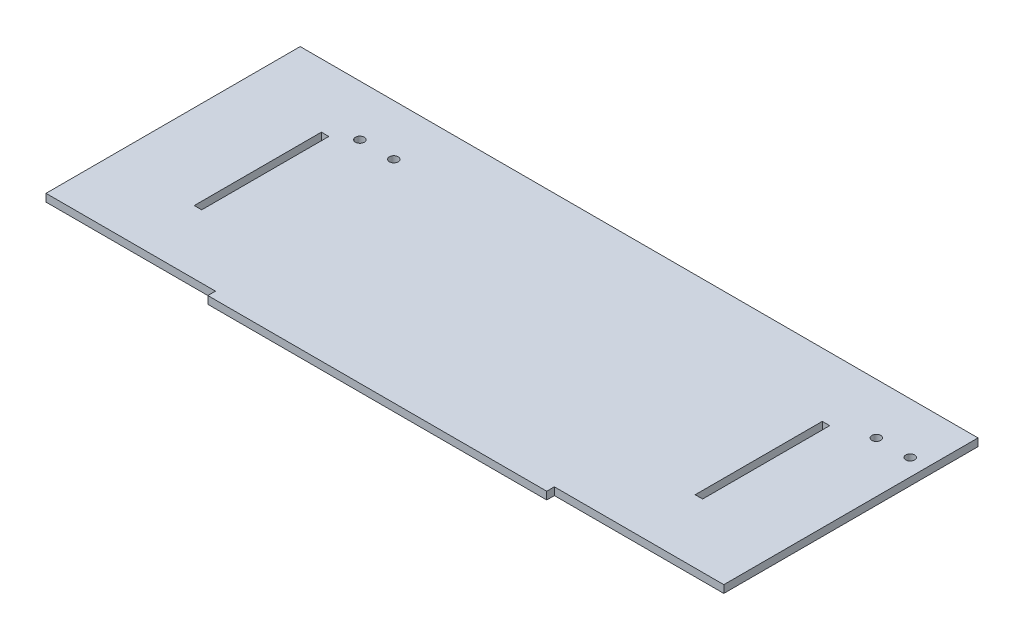
ISO-10303-21;
HEADER;
FILE_DESCRIPTION(('STEP AP214'),'2;1');
FILE_NAME('part.step','',(''),(''),'','','');
FILE_SCHEMA(('AUTOMOTIVE_DESIGN { 1 0 10303 214 1 1 1 1 }'));
ENDSEC;
DATA;
#1=APPLICATION_CONTEXT('core data for automotive mechanical design processes');
#2=APPLICATION_PROTOCOL_DEFINITION('international standard','automotive_design',2000,#1);
#3=PRODUCT_CONTEXT('',#1,'mechanical');
#4=PRODUCT('Part','Part','',(#3));
#5=PRODUCT_RELATED_PRODUCT_CATEGORY('part','',(#4));
#6=PRODUCT_DEFINITION_FORMATION('','',#4);
#7=PRODUCT_DEFINITION_CONTEXT('part definition',#1,'design');
#8=PRODUCT_DEFINITION('design','',#6,#7);
#9=PRODUCT_DEFINITION_SHAPE('','',#8);
#10=(LENGTH_UNIT() NAMED_UNIT(*) SI_UNIT(.MILLI.,.METRE.));
#11=(NAMED_UNIT(*) PLANE_ANGLE_UNIT() SI_UNIT($,.RADIAN.));
#12=(NAMED_UNIT(*) SI_UNIT($,.STERADIAN.) SOLID_ANGLE_UNIT());
#13=UNCERTAINTY_MEASURE_WITH_UNIT(LENGTH_MEASURE(1.E-05),#10,'distance_accuracy_value','');
#14=(GEOMETRIC_REPRESENTATION_CONTEXT(3) GLOBAL_UNCERTAINTY_ASSIGNED_CONTEXT((#13)) GLOBAL_UNIT_ASSIGNED_CONTEXT((#10,
#11,#12)) REPRESENTATION_CONTEXT('',''));
#15=CARTESIAN_POINT('',(0.,0.,0.));
#16=DIRECTION('',(0.,0.,1.));
#17=DIRECTION('',(1.,0.,0.));
#18=AXIS2_PLACEMENT_3D('',#15,#16,#17);
#19=CARTESIAN_POINT('',(0.,4.5,75.));
#20=DIRECTION('',(0.,0.,-1.));
#21=DIRECTION('',(-1.,0.,0.));
#22=AXIS2_PLACEMENT_3D('',#19,#20,#21);
#23=PLANE('',#22);
#24=DIRECTION('',(1.,0.,0.));
#25=VECTOR('',#24,1.);
#26=CARTESIAN_POINT('',(0.,0.,75.));
#27=LINE('',#26,#25);
#28=CARTESIAN_POINT('',(-200.,0.,75.));
#29=VERTEX_POINT('',#28);
#30=CARTESIAN_POINT('',(-100.,0.,75.));
#31=VERTEX_POINT('',#30);
#32=EDGE_CURVE('E228',#29,#31,#27,.T.);
#33=ORIENTED_EDGE('',*,*,#32,.T.);
#34=DIRECTION('',(0.,-1.,0.));
#35=VECTOR('',#34,1.);
#36=CARTESIAN_POINT('',(-100.,4.5,75.));
#37=LINE('',#36,#35);
#38=CARTESIAN_POINT('',(-100.,4.5,75.));
#39=VERTEX_POINT('',#38);
#40=EDGE_CURVE('E11',#39,#31,#37,.T.);
#41=ORIENTED_EDGE('',*,*,#40,.F.);
#42=DIRECTION('',(1.,0.,0.));
#43=VECTOR('',#42,1.);
#44=CARTESIAN_POINT('',(0.,4.5,75.));
#45=LINE('',#44,#43);
#46=CARTESIAN_POINT('',(-200.,4.5,75.));
#47=VERTEX_POINT('',#46);
#48=EDGE_CURVE('E229',#47,#39,#45,.T.);
#49=ORIENTED_EDGE('',*,*,#48,.F.);
#50=DIRECTION('',(0.,-1.,0.));
#51=VECTOR('',#50,1.);
#52=CARTESIAN_POINT('',(-200.,4.5,75.));
#53=LINE('',#52,#51);
#54=EDGE_CURVE('E256',#47,#29,#53,.T.);
#55=ORIENTED_EDGE('',*,*,#54,.T.);
#56=EDGE_LOOP('',(#33,#41,#49,#55));
#57=FACE_BOUND('',#56,.T.);
#58=ADVANCED_FACE('F44',(#57),#23,.F.);
#59=CARTESIAN_POINT('',(-100.,4.5,0.));
#60=DIRECTION('',(1.,0.,0.));
#61=DIRECTION('',(0.,0.,-1.));
#62=AXIS2_PLACEMENT_3D('',#59,#60,#61);
#63=PLANE('',#62);
#64=DIRECTION('',(0.,0.,1.));
#65=VECTOR('',#64,1.);
#66=CARTESIAN_POINT('',(-100.,0.,0.));
#67=LINE('',#66,#65);
#68=CARTESIAN_POINT('',(-100.,0.,79.5));
#69=VERTEX_POINT('',#68);
#70=EDGE_CURVE('E260',#31,#69,#67,.T.);
#71=ORIENTED_EDGE('',*,*,#70,.T.);
#72=DIRECTION('',(0.,-1.,0.));
#73=VECTOR('',#72,1.);
#74=CARTESIAN_POINT('',(-100.,4.5,79.5));
#75=LINE('',#74,#73);
#76=CARTESIAN_POINT('',(-100.,4.5,79.5));
#77=VERTEX_POINT('',#76);
#78=EDGE_CURVE('E53',#77,#69,#75,.T.);
#79=ORIENTED_EDGE('',*,*,#78,.F.);
#80=DIRECTION('',(0.,0.,1.));
#81=VECTOR('',#80,1.);
#82=CARTESIAN_POINT('',(-100.,4.5,0.));
#83=LINE('',#82,#81);
#84=EDGE_CURVE('E233',#39,#77,#83,.T.);
#85=ORIENTED_EDGE('',*,*,#84,.F.);
#86=ORIENTED_EDGE('',*,*,#40,.T.);
#87=EDGE_LOOP('',(#71,#79,#85,#86));
#88=FACE_BOUND('',#87,.T.);
#89=ADVANCED_FACE('F46',(#88),#63,.F.);
#90=CARTESIAN_POINT('',(0.,4.5,79.5));
#91=DIRECTION('',(0.,0.,-1.));
#92=DIRECTION('',(-1.,0.,0.));
#93=AXIS2_PLACEMENT_3D('',#90,#91,#92);
#94=PLANE('',#93);
#95=DIRECTION('',(1.,0.,0.));
#96=VECTOR('',#95,1.);
#97=CARTESIAN_POINT('',(0.,0.,79.5));
#98=LINE('',#97,#96);
#99=CARTESIAN_POINT('',(99.9999999999998,0.,79.5));
#100=VERTEX_POINT('',#99);
#101=EDGE_CURVE('E264',#69,#100,#98,.T.);
#102=ORIENTED_EDGE('',*,*,#101,.T.);
#103=DIRECTION('',(0.,-1.,0.));
#104=VECTOR('',#103,1.);
#105=CARTESIAN_POINT('',(99.9999999999998,4.5,79.5));
#106=LINE('',#105,#104);
#107=CARTESIAN_POINT('',(99.9999999999998,4.5,79.5));
#108=VERTEX_POINT('',#107);
#109=EDGE_CURVE('E297',#108,#100,#106,.T.);
#110=ORIENTED_EDGE('',*,*,#109,.F.);
#111=DIRECTION('',(1.,0.,0.));
#112=VECTOR('',#111,1.);
#113=CARTESIAN_POINT('',(0.,4.5,79.5));
#114=LINE('',#113,#112);
#115=EDGE_CURVE('E238',#77,#108,#114,.T.);
#116=ORIENTED_EDGE('',*,*,#115,.F.);
#117=ORIENTED_EDGE('',*,*,#78,.T.);
#118=EDGE_LOOP('',(#102,#110,#116,#117));
#119=FACE_BOUND('',#118,.T.);
#120=ADVANCED_FACE('F305',(#119),#94,.F.);
#121=CARTESIAN_POINT('',(99.9999999999998,4.5,0.));
#122=DIRECTION('',(1.,0.,0.));
#123=DIRECTION('',(0.,0.,-1.));
#124=AXIS2_PLACEMENT_3D('',#121,#122,#123);
#125=PLANE('',#124);
#126=DIRECTION('',(0.,0.,1.));
#127=VECTOR('',#126,1.);
#128=CARTESIAN_POINT('',(99.9999999999998,0.,0.));
#129=LINE('',#128,#127);
#130=CARTESIAN_POINT('',(99.9999999999998,0.,75.));
#131=VERTEX_POINT('',#130);
#132=EDGE_CURVE('E268',#131,#100,#129,.T.);
#133=ORIENTED_EDGE('',*,*,#132,.F.);
#134=DIRECTION('',(0.,-1.,0.));
#135=VECTOR('',#134,1.);
#136=CARTESIAN_POINT('',(99.9999999999998,4.5,75.));
#137=LINE('',#136,#135);
#138=CARTESIAN_POINT('',(99.9999999999998,4.5,75.));
#139=VERTEX_POINT('',#138);
#140=EDGE_CURVE('E294',#139,#131,#137,.T.);
#141=ORIENTED_EDGE('',*,*,#140,.F.);
#142=DIRECTION('',(0.,0.,1.));
#143=VECTOR('',#142,1.);
#144=CARTESIAN_POINT('',(99.9999999999998,4.5,0.));
#145=LINE('',#144,#143);
#146=EDGE_CURVE('E241',#139,#108,#145,.T.);
#147=ORIENTED_EDGE('',*,*,#146,.T.);
#148=ORIENTED_EDGE('',*,*,#109,.T.);
#149=EDGE_LOOP('',(#133,#141,#147,#148));
#150=FACE_BOUND('',#149,.T.);
#151=ADVANCED_FACE('F315',(#150),#125,.T.);
#152=CARTESIAN_POINT('',(200.,0.,75.));
#153=VERTEX_POINT('',#152);
#154=EDGE_CURVE('E261',#131,#153,#27,.T.);
#155=ORIENTED_EDGE('',*,*,#154,.T.);
#156=DIRECTION('',(0.,-1.,0.));
#157=VECTOR('',#156,1.);
#158=CARTESIAN_POINT('',(200.,4.5,75.));
#159=LINE('',#158,#157);
#160=CARTESIAN_POINT('',(200.,4.5,75.));
#161=VERTEX_POINT('',#160);
#162=EDGE_CURVE('E291',#161,#153,#159,.T.);
#163=ORIENTED_EDGE('',*,*,#162,.F.);
#164=EDGE_CURVE('E235',#139,#161,#45,.T.);
#165=ORIENTED_EDGE('',*,*,#164,.F.);
#166=ORIENTED_EDGE('',*,*,#140,.T.);
#167=EDGE_LOOP('',(#155,#163,#165,#166));
#168=FACE_BOUND('',#167,.T.);
#169=ADVANCED_FACE('F336',(#168),#23,.F.);
#170=CARTESIAN_POINT('',(200.,4.5,0.));
#171=DIRECTION('',(1.,0.,0.));
#172=DIRECTION('',(0.,0.,-1.));
#173=AXIS2_PLACEMENT_3D('',#170,#171,#172);
#174=PLANE('',#173);
#175=DIRECTION('',(0.,0.,1.));
#176=VECTOR('',#175,1.);
#177=CARTESIAN_POINT('',(200.,0.,0.));
#178=LINE('',#177,#176);
#179=CARTESIAN_POINT('',(200.,0.,-75.));
#180=VERTEX_POINT('',#179);
#181=EDGE_CURVE('E272',#180,#153,#178,.T.);
#182=ORIENTED_EDGE('',*,*,#181,.F.);
#183=DIRECTION('',(0.,-1.,0.));
#184=VECTOR('',#183,1.);
#185=CARTESIAN_POINT('',(200.,4.5,-75.));
#186=LINE('',#185,#184);
#187=CARTESIAN_POINT('',(200.,4.5,-75.));
#188=VERTEX_POINT('',#187);
#189=EDGE_CURVE('E288',#188,#180,#186,.T.);
#190=ORIENTED_EDGE('',*,*,#189,.F.);
#191=DIRECTION('',(0.,0.,1.));
#192=VECTOR('',#191,1.);
#193=CARTESIAN_POINT('',(200.,4.5,0.));
#194=LINE('',#193,#192);
#195=EDGE_CURVE('E245',#188,#161,#194,.T.);
#196=ORIENTED_EDGE('',*,*,#195,.T.);
#197=ORIENTED_EDGE('',*,*,#162,.T.);
#198=EDGE_LOOP('',(#182,#190,#196,#197));
#199=FACE_BOUND('',#198,.T.);
#200=ADVANCED_FACE('F334',(#199),#174,.T.);
#201=CARTESIAN_POINT('',(0.,4.5,-75.));
#202=DIRECTION('',(0.,0.,-1.));
#203=DIRECTION('',(-1.,0.,0.));
#204=AXIS2_PLACEMENT_3D('',#201,#202,#203);
#205=PLANE('',#204);
#206=DIRECTION('',(1.,0.,0.));
#207=VECTOR('',#206,1.);
#208=CARTESIAN_POINT('',(0.,0.,-75.));
#209=LINE('',#208,#207);
#210=CARTESIAN_POINT('',(-200.,0.,-75.));
#211=VERTEX_POINT('',#210);
#212=EDGE_CURVE('E276',#211,#180,#209,.T.);
#213=ORIENTED_EDGE('',*,*,#212,.F.);
#214=DIRECTION('',(0.,-1.,0.));
#215=VECTOR('',#214,1.);
#216=CARTESIAN_POINT('',(-200.,4.5,-75.));
#217=LINE('',#216,#215);
#218=CARTESIAN_POINT('',(-200.,4.5,-75.));
#219=VERTEX_POINT('',#218);
#220=EDGE_CURVE('E285',#219,#211,#217,.T.);
#221=ORIENTED_EDGE('',*,*,#220,.F.);
#222=DIRECTION('',(1.,0.,0.));
#223=VECTOR('',#222,1.);
#224=CARTESIAN_POINT('',(0.,4.5,-75.));
#225=LINE('',#224,#223);
#226=EDGE_CURVE('E249',#219,#188,#225,.T.);
#227=ORIENTED_EDGE('',*,*,#226,.T.);
#228=ORIENTED_EDGE('',*,*,#189,.T.);
#229=EDGE_LOOP('',(#213,#221,#227,#228));
#230=FACE_BOUND('',#229,.T.);
#231=ADVANCED_FACE('F329',(#230),#205,.T.);
#232=CARTESIAN_POINT('',(-200.,4.5,0.));
#233=DIRECTION('',(1.,0.,0.));
#234=DIRECTION('',(0.,0.,-1.));
#235=AXIS2_PLACEMENT_3D('',#232,#233,#234);
#236=PLANE('',#235);
#237=DIRECTION('',(0.,0.,1.));
#238=VECTOR('',#237,1.);
#239=CARTESIAN_POINT('',(-200.,0.,0.));
#240=LINE('',#239,#238);
#241=EDGE_CURVE('E234',#211,#29,#240,.T.);
#242=ORIENTED_EDGE('',*,*,#241,.T.);
#243=ORIENTED_EDGE('',*,*,#54,.F.);
#244=DIRECTION('',(0.,0.,1.));
#245=VECTOR('',#244,1.);
#246=CARTESIAN_POINT('',(-200.,4.5,0.));
#247=LINE('',#246,#245);
#248=EDGE_CURVE('E253',#219,#47,#247,.T.);
#249=ORIENTED_EDGE('',*,*,#248,.F.);
#250=ORIENTED_EDGE('',*,*,#220,.T.);
#251=EDGE_LOOP('',(#242,#243,#249,#250));
#252=FACE_BOUND('',#251,.T.);
#253=ADVANCED_FACE('F382',(#252),#236,.F.);
#254=CARTESIAN_POINT('',(0.,4.5,0.));
#255=DIRECTION('',(0.,1.,0.));
#256=DIRECTION('',(0.,0.,1.));
#257=AXIS2_PLACEMENT_3D('',#254,#255,#256);
#258=PLANE('',#257);
#259=CARTESIAN_POINT('',(190.,4.5,-45.));
#260=DIRECTION('',(0.,1.,0.));
#261=DIRECTION('',(0.,0.,1.));
#262=AXIS2_PLACEMENT_3D('',#259,#260,#261);
#263=CIRCLE('',#262,2.59999999999999);
#264=CARTESIAN_POINT('',(190.,4.5,-42.4));
#265=VERTEX_POINT('',#264);
#266=EDGE_CURVE('E587',#265,#265,#263,.T.);
#267=ORIENTED_EDGE('',*,*,#266,.F.);
#268=EDGE_LOOP('',(#267));
#269=FACE_BOUND('',#268,.T.);
#270=CARTESIAN_POINT('',(-134.777861761989,4.5,-45.));
#271=DIRECTION('',(0.,1.,0.));
#272=DIRECTION('',(0.,0.,1.));
#273=AXIS2_PLACEMENT_3D('',#270,#271,#272);
#274=CIRCLE('',#273,2.59999999999999);
#275=CARTESIAN_POINT('',(-134.777861761989,4.5,-42.4));
#276=VERTEX_POINT('',#275);
#277=EDGE_CURVE('E597',#276,#276,#274,.T.);
#278=ORIENTED_EDGE('',*,*,#277,.F.);
#279=EDGE_LOOP('',(#278));
#280=FACE_BOUND('',#279,.T.);
#281=CARTESIAN_POINT('',(170.,4.5,-45.));
#282=DIRECTION('',(0.,1.,0.));
#283=DIRECTION('',(0.,0.,1.));
#284=AXIS2_PLACEMENT_3D('',#281,#282,#283);
#285=CIRCLE('',#284,2.59999999999999);
#286=CARTESIAN_POINT('',(170.,4.5,-42.4));
#287=VERTEX_POINT('',#286);
#288=EDGE_CURVE('E605',#287,#287,#285,.T.);
#289=ORIENTED_EDGE('',*,*,#288,.F.);
#290=EDGE_LOOP('',(#289));
#291=FACE_BOUND('',#290,.T.);
#292=CARTESIAN_POINT('',(-114.777861761989,4.5,-44.9999999999999));
#293=DIRECTION('',(0.,1.,0.));
#294=DIRECTION('',(0.,0.,1.));
#295=AXIS2_PLACEMENT_3D('',#292,#293,#294);
#296=CIRCLE('',#295,2.6);
#297=CARTESIAN_POINT('',(-114.777861761989,4.5,-42.3999999999999));
#298=VERTEX_POINT('',#297);
#299=EDGE_CURVE('E600',#298,#298,#296,.T.);
#300=ORIENTED_EDGE('',*,*,#299,.F.);
#301=EDGE_LOOP('',(#300));
#302=FACE_BOUND('',#301,.T.);
#303=DIRECTION('',(-1.,0.,0.));
#304=VECTOR('',#303,1.);
#305=CARTESIAN_POINT('',(150.,4.5,37.5));
#306=LINE('',#305,#304);
#307=CARTESIAN_POINT('',(150.,4.5,37.5));
#308=VERTEX_POINT('',#307);
#309=CARTESIAN_POINT('',(145.6,4.5,37.5));
#310=VERTEX_POINT('',#309);
#311=EDGE_CURVE('E160',#308,#310,#306,.T.);
#312=ORIENTED_EDGE('',*,*,#311,.T.);
#313=DIRECTION('',(0.,0.,-1.));
#314=VECTOR('',#313,1.);
#315=CARTESIAN_POINT('',(145.6,4.5,37.5));
#316=LINE('',#315,#314);
#317=CARTESIAN_POINT('',(145.6,4.5,-37.5));
#318=VERTEX_POINT('',#317);
#319=EDGE_CURVE('E167',#310,#318,#316,.T.);
#320=ORIENTED_EDGE('',*,*,#319,.T.);
#321=DIRECTION('',(-1.,0.,0.));
#322=VECTOR('',#321,1.);
#323=CARTESIAN_POINT('',(150.,4.5,-37.5));
#324=LINE('',#323,#322);
#325=CARTESIAN_POINT('',(150.,4.5,-37.5));
#326=VERTEX_POINT('',#325);
#327=EDGE_CURVE('E60',#326,#318,#324,.T.);
#328=ORIENTED_EDGE('',*,*,#327,.F.);
#329=DIRECTION('',(0.,0.,-1.));
#330=VECTOR('',#329,1.);
#331=CARTESIAN_POINT('',(150.,4.5,37.5));
#332=LINE('',#331,#330);
#333=EDGE_CURVE('E178',#308,#326,#332,.T.);
#334=ORIENTED_EDGE('',*,*,#333,.F.);
#335=EDGE_LOOP('',(#312,#320,#328,#334));
#336=FACE_BOUND('',#335,.T.);
#337=DIRECTION('',(1.,0.,0.));
#338=VECTOR('',#337,1.);
#339=CARTESIAN_POINT('',(-150.,4.5,37.5));
#340=LINE('',#339,#338);
#341=CARTESIAN_POINT('',(-150.,4.5,37.5));
#342=VERTEX_POINT('',#341);
#343=CARTESIAN_POINT('',(-145.6,4.5,37.5));
#344=VERTEX_POINT('',#343);
#345=EDGE_CURVE('E180',#342,#344,#340,.T.);
#346=ORIENTED_EDGE('',*,*,#345,.F.);
#347=DIRECTION('',(0.,0.,-1.));
#348=VECTOR('',#347,1.);
#349=CARTESIAN_POINT('',(-150.,4.5,37.5));
#350=LINE('',#349,#348);
#351=CARTESIAN_POINT('',(-150.,4.5,-37.5));
#352=VERTEX_POINT('',#351);
#353=EDGE_CURVE('E210',#342,#352,#350,.T.);
#354=ORIENTED_EDGE('',*,*,#353,.T.);
#355=DIRECTION('',(1.,0.,0.));
#356=VECTOR('',#355,1.);
#357=CARTESIAN_POINT('',(-150.,4.5,-37.5));
#358=LINE('',#357,#356);
#359=CARTESIAN_POINT('',(-145.6,4.5,-37.5));
#360=VERTEX_POINT('',#359);
#361=EDGE_CURVE('E206',#352,#360,#358,.T.);
#362=ORIENTED_EDGE('',*,*,#361,.T.);
#363=DIRECTION('',(0.,0.,-1.));
#364=VECTOR('',#363,1.);
#365=CARTESIAN_POINT('',(-145.6,4.5,37.5));
#366=LINE('',#365,#364);
#367=EDGE_CURVE('E184',#344,#360,#366,.T.);
#368=ORIENTED_EDGE('',*,*,#367,.F.);
#369=EDGE_LOOP('',(#346,#354,#362,#368));
#370=FACE_BOUND('',#369,.T.);
#371=ORIENTED_EDGE('',*,*,#48,.T.);
#372=ORIENTED_EDGE('',*,*,#84,.T.);
#373=ORIENTED_EDGE('',*,*,#115,.T.);
#374=ORIENTED_EDGE('',*,*,#146,.F.);
#375=ORIENTED_EDGE('',*,*,#164,.T.);
#376=ORIENTED_EDGE('',*,*,#195,.F.);
#377=ORIENTED_EDGE('',*,*,#226,.F.);
#378=ORIENTED_EDGE('',*,*,#248,.T.);
#379=EDGE_LOOP('',(#371,#372,#373,#374,#375,#376,#377,#378));
#380=FACE_BOUND('',#379,.T.);
#381=ADVANCED_FACE('F175',(#269,#280,#291,#302,#336,#370,#380),#258,.T.);
#382=CARTESIAN_POINT('',(0.,0.,0.));
#383=DIRECTION('',(0.,1.,0.));
#384=DIRECTION('',(0.,0.,1.));
#385=AXIS2_PLACEMENT_3D('',#382,#383,#384);
#386=PLANE('',#385);
#387=CARTESIAN_POINT('',(190.,0.,-45.));
#388=DIRECTION('',(0.,1.,0.));
#389=DIRECTION('',(0.,0.,1.));
#390=AXIS2_PLACEMENT_3D('',#387,#388,#389);
#391=CIRCLE('',#390,2.59999999999999);
#392=CARTESIAN_POINT('',(190.,0.,-42.4));
#393=VERTEX_POINT('',#392);
#394=EDGE_CURVE('E590',#393,#393,#391,.F.);
#395=ORIENTED_EDGE('',*,*,#394,.F.);
#396=EDGE_LOOP('',(#395));
#397=FACE_BOUND('',#396,.T.);
#398=CARTESIAN_POINT('',(-134.777861761989,0.,-45.));
#399=DIRECTION('',(0.,1.,0.));
#400=DIRECTION('',(0.,0.,1.));
#401=AXIS2_PLACEMENT_3D('',#398,#399,#400);
#402=CIRCLE('',#401,2.59999999999999);
#403=CARTESIAN_POINT('',(-134.777861761989,0.,-42.4));
#404=VERTEX_POINT('',#403);
#405=EDGE_CURVE('E594',#404,#404,#402,.F.);
#406=ORIENTED_EDGE('',*,*,#405,.F.);
#407=EDGE_LOOP('',(#406));
#408=FACE_BOUND('',#407,.T.);
#409=CARTESIAN_POINT('',(170.,0.,-45.));
#410=DIRECTION('',(0.,1.,0.));
#411=DIRECTION('',(0.,0.,1.));
#412=AXIS2_PLACEMENT_3D('',#409,#410,#411);
#413=CIRCLE('',#412,2.59999999999999);
#414=CARTESIAN_POINT('',(170.,0.,-42.4));
#415=VERTEX_POINT('',#414);
#416=EDGE_CURVE('E645',#415,#415,#413,.F.);
#417=ORIENTED_EDGE('',*,*,#416,.F.);
#418=EDGE_LOOP('',(#417));
#419=FACE_BOUND('',#418,.T.);
#420=CARTESIAN_POINT('',(-114.777861761989,0.,-44.9999999999999));
#421=DIRECTION('',(0.,1.,0.));
#422=DIRECTION('',(0.,0.,1.));
#423=AXIS2_PLACEMENT_3D('',#420,#421,#422);
#424=CIRCLE('',#423,2.6);
#425=CARTESIAN_POINT('',(-114.777861761989,0.,-42.3999999999999));
#426=VERTEX_POINT('',#425);
#427=EDGE_CURVE('E604',#426,#426,#424,.F.);
#428=ORIENTED_EDGE('',*,*,#427,.F.);
#429=EDGE_LOOP('',(#428));
#430=FACE_BOUND('',#429,.T.);
#431=DIRECTION('',(0.,0.,1.));
#432=VECTOR('',#431,1.);
#433=CARTESIAN_POINT('',(145.6,0.,37.5));
#434=LINE('',#433,#432);
#435=CARTESIAN_POINT('',(145.6,0.,-37.5));
#436=VERTEX_POINT('',#435);
#437=CARTESIAN_POINT('',(145.6,0.,37.5));
#438=VERTEX_POINT('',#437);
#439=EDGE_CURVE('E173',#436,#438,#434,.T.);
#440=ORIENTED_EDGE('',*,*,#439,.T.);
#441=DIRECTION('',(1.,0.,0.));
#442=VECTOR('',#441,1.);
#443=CARTESIAN_POINT('',(150.,0.,37.5));
#444=LINE('',#443,#442);
#445=CARTESIAN_POINT('',(150.,0.,37.5));
#446=VERTEX_POINT('',#445);
#447=EDGE_CURVE('E68',#438,#446,#444,.T.);
#448=ORIENTED_EDGE('',*,*,#447,.T.);
#449=DIRECTION('',(0.,0.,1.));
#450=VECTOR('',#449,1.);
#451=CARTESIAN_POINT('',(150.,0.,37.5));
#452=LINE('',#451,#450);
#453=CARTESIAN_POINT('',(150.,0.,-37.5));
#454=VERTEX_POINT('',#453);
#455=EDGE_CURVE('E186',#454,#446,#452,.T.);
#456=ORIENTED_EDGE('',*,*,#455,.F.);
#457=DIRECTION('',(1.,0.,0.));
#458=VECTOR('',#457,1.);
#459=CARTESIAN_POINT('',(150.,0.,-37.5));
#460=LINE('',#459,#458);
#461=EDGE_CURVE('E618',#436,#454,#460,.T.);
#462=ORIENTED_EDGE('',*,*,#461,.F.);
#463=EDGE_LOOP('',(#440,#448,#456,#462));
#464=FACE_BOUND('',#463,.T.);
#465=DIRECTION('',(0.,0.,1.));
#466=VECTOR('',#465,1.);
#467=CARTESIAN_POINT('',(-150.,0.,37.5));
#468=LINE('',#467,#466);
#469=CARTESIAN_POINT('',(-150.,0.,-37.5));
#470=VERTEX_POINT('',#469);
#471=CARTESIAN_POINT('',(-150.,0.,37.5));
#472=VERTEX_POINT('',#471);
#473=EDGE_CURVE('E194',#470,#472,#468,.T.);
#474=ORIENTED_EDGE('',*,*,#473,.T.);
#475=DIRECTION('',(-1.,0.,0.));
#476=VECTOR('',#475,1.);
#477=CARTESIAN_POINT('',(-150.,0.,37.5));
#478=LINE('',#477,#476);
#479=CARTESIAN_POINT('',(-145.6,0.,37.5));
#480=VERTEX_POINT('',#479);
#481=EDGE_CURVE('E199',#480,#472,#478,.T.);
#482=ORIENTED_EDGE('',*,*,#481,.F.);
#483=DIRECTION('',(0.,0.,1.));
#484=VECTOR('',#483,1.);
#485=CARTESIAN_POINT('',(-145.6,0.,37.5));
#486=LINE('',#485,#484);
#487=CARTESIAN_POINT('',(-145.6,0.,-37.5));
#488=VERTEX_POINT('',#487);
#489=EDGE_CURVE('E201',#488,#480,#486,.T.);
#490=ORIENTED_EDGE('',*,*,#489,.F.);
#491=DIRECTION('',(-1.,0.,0.));
#492=VECTOR('',#491,1.);
#493=CARTESIAN_POINT('',(-150.,0.,-37.5));
#494=LINE('',#493,#492);
#495=EDGE_CURVE('E190',#488,#470,#494,.T.);
#496=ORIENTED_EDGE('',*,*,#495,.T.);
#497=EDGE_LOOP('',(#474,#482,#490,#496));
#498=FACE_BOUND('',#497,.T.);
#499=ORIENTED_EDGE('',*,*,#32,.F.);
#500=ORIENTED_EDGE('',*,*,#241,.F.);
#501=ORIENTED_EDGE('',*,*,#212,.T.);
#502=ORIENTED_EDGE('',*,*,#181,.T.);
#503=ORIENTED_EDGE('',*,*,#154,.F.);
#504=ORIENTED_EDGE('',*,*,#132,.T.);
#505=ORIENTED_EDGE('',*,*,#101,.F.);
#506=ORIENTED_EDGE('',*,*,#70,.F.);
#507=EDGE_LOOP('',(#499,#500,#501,#502,#503,#504,#505,#506));
#508=FACE_BOUND('',#507,.T.);
#509=ADVANCED_FACE('F310',(#397,#408,#419,#430,#464,#498,#508),#386,.F.);
#510=CARTESIAN_POINT('',(-150.,-75.128955802673,37.5));
#511=DIRECTION('',(0.,0.,1.));
#512=DIRECTION('',(1.,0.,0.));
#513=AXIS2_PLACEMENT_3D('',#510,#511,#512);
#514=PLANE('',#513);
#515=ORIENTED_EDGE('',*,*,#481,.T.);
#516=DIRECTION('',(0.,1.,0.));
#517=VECTOR('',#516,1.);
#518=CARTESIAN_POINT('',(-150.,-75.128955802673,37.5));
#519=LINE('',#518,#517);
#520=EDGE_CURVE('E195',#472,#342,#519,.T.);
#521=ORIENTED_EDGE('',*,*,#520,.T.);
#522=ORIENTED_EDGE('',*,*,#345,.T.);
#523=DIRECTION('',(0.,1.,0.));
#524=VECTOR('',#523,1.);
#525=CARTESIAN_POINT('',(-145.6,-75.128955802673,37.5));
#526=LINE('',#525,#524);
#527=EDGE_CURVE('E214',#480,#344,#526,.T.);
#528=ORIENTED_EDGE('',*,*,#527,.F.);
#529=EDGE_LOOP('',(#515,#521,#522,#528));
#530=FACE_BOUND('',#529,.T.);
#531=ADVANCED_FACE('F399',(#530),#514,.F.);
#532=CARTESIAN_POINT('',(-150.,-75.128955802673,37.5));
#533=DIRECTION('',(1.,0.,0.));
#534=DIRECTION('',(0.,0.,-1.));
#535=AXIS2_PLACEMENT_3D('',#532,#533,#534);
#536=PLANE('',#535);
#537=DIRECTION('',(0.,1.,0.));
#538=VECTOR('',#537,1.);
#539=CARTESIAN_POINT('',(-150.,-75.128955802673,-37.5));
#540=LINE('',#539,#538);
#541=EDGE_CURVE('E217',#470,#352,#540,.T.);
#542=ORIENTED_EDGE('',*,*,#541,.T.);
#543=ORIENTED_EDGE('',*,*,#353,.F.);
#544=ORIENTED_EDGE('',*,*,#520,.F.);
#545=ORIENTED_EDGE('',*,*,#473,.F.);
#546=EDGE_LOOP('',(#542,#543,#544,#545));
#547=FACE_BOUND('',#546,.T.);
#548=ADVANCED_FACE('F404',(#547),#536,.T.);
#549=CARTESIAN_POINT('',(-150.,-75.128955802673,-37.5));
#550=DIRECTION('',(0.,0.,1.));
#551=DIRECTION('',(1.,0.,0.));
#552=AXIS2_PLACEMENT_3D('',#549,#550,#551);
#553=PLANE('',#552);
#554=DIRECTION('',(0.,1.,0.));
#555=VECTOR('',#554,1.);
#556=CARTESIAN_POINT('',(-145.6,-75.128955802673,-37.5));
#557=LINE('',#556,#555);
#558=EDGE_CURVE('E220',#488,#360,#557,.T.);
#559=ORIENTED_EDGE('',*,*,#558,.T.);
#560=ORIENTED_EDGE('',*,*,#361,.F.);
#561=ORIENTED_EDGE('',*,*,#541,.F.);
#562=ORIENTED_EDGE('',*,*,#495,.F.);
#563=EDGE_LOOP('',(#559,#560,#561,#562));
#564=FACE_BOUND('',#563,.T.);
#565=ADVANCED_FACE('F417',(#564),#553,.T.);
#566=CARTESIAN_POINT('',(-145.6,-75.128955802673,37.5));
#567=DIRECTION('',(1.,0.,0.));
#568=DIRECTION('',(0.,0.,-1.));
#569=AXIS2_PLACEMENT_3D('',#566,#567,#568);
#570=PLANE('',#569);
#571=ORIENTED_EDGE('',*,*,#489,.T.);
#572=ORIENTED_EDGE('',*,*,#527,.T.);
#573=ORIENTED_EDGE('',*,*,#367,.T.);
#574=ORIENTED_EDGE('',*,*,#558,.F.);
#575=EDGE_LOOP('',(#571,#572,#573,#574));
#576=FACE_BOUND('',#575,.T.);
#577=ADVANCED_FACE('F428',(#576),#570,.F.);
#578=CARTESIAN_POINT('',(150.,-75.128955802673,37.5));
#579=DIRECTION('',(0.,0.,1.));
#580=DIRECTION('',(-1.,0.,0.));
#581=AXIS2_PLACEMENT_3D('',#578,#579,#580);
#582=PLANE('',#581);
#583=ORIENTED_EDGE('',*,*,#447,.F.);
#584=DIRECTION('',(0.,1.,0.));
#585=VECTOR('',#584,1.);
#586=CARTESIAN_POINT('',(145.6,-75.128955802673,37.5));
#587=LINE('',#586,#585);
#588=EDGE_CURVE('E156',#438,#310,#587,.T.);
#589=ORIENTED_EDGE('',*,*,#588,.T.);
#590=ORIENTED_EDGE('',*,*,#311,.F.);
#591=DIRECTION('',(0.,1.,0.));
#592=VECTOR('',#591,1.);
#593=CARTESIAN_POINT('',(150.,-75.128955802673,37.5));
#594=LINE('',#593,#592);
#595=EDGE_CURVE('E624',#446,#308,#594,.T.);
#596=ORIENTED_EDGE('',*,*,#595,.F.);
#597=EDGE_LOOP('',(#583,#589,#590,#596));
#598=FACE_BOUND('',#597,.T.);
#599=ADVANCED_FACE('F158',(#598),#582,.F.);
#600=CARTESIAN_POINT('',(150.,-75.128955802673,37.5));
#601=DIRECTION('',(-1.,0.,0.));
#602=DIRECTION('',(0.,0.,-1.));
#603=AXIS2_PLACEMENT_3D('',#600,#601,#602);
#604=PLANE('',#603);
#605=DIRECTION('',(0.,1.,0.));
#606=VECTOR('',#605,1.);
#607=CARTESIAN_POINT('',(150.,-75.128955802673,-37.5));
#608=LINE('',#607,#606);
#609=EDGE_CURVE('E615',#454,#326,#608,.T.);
#610=ORIENTED_EDGE('',*,*,#609,.F.);
#611=ORIENTED_EDGE('',*,*,#455,.T.);
#612=ORIENTED_EDGE('',*,*,#595,.T.);
#613=ORIENTED_EDGE('',*,*,#333,.T.);
#614=EDGE_LOOP('',(#610,#611,#612,#613));
#615=FACE_BOUND('',#614,.T.);
#616=ADVANCED_FACE('F449',(#615),#604,.T.);
#617=CARTESIAN_POINT('',(150.,-75.128955802673,-37.5));
#618=DIRECTION('',(0.,0.,1.));
#619=DIRECTION('',(-1.,0.,0.));
#620=AXIS2_PLACEMENT_3D('',#617,#618,#619);
#621=PLANE('',#620);
#622=DIRECTION('',(0.,1.,0.));
#623=VECTOR('',#622,1.);
#624=CARTESIAN_POINT('',(145.6,-75.128955802673,-37.5));
#625=LINE('',#624,#623);
#626=EDGE_CURVE('E166',#436,#318,#625,.T.);
#627=ORIENTED_EDGE('',*,*,#626,.F.);
#628=ORIENTED_EDGE('',*,*,#461,.T.);
#629=ORIENTED_EDGE('',*,*,#609,.T.);
#630=ORIENTED_EDGE('',*,*,#327,.T.);
#631=EDGE_LOOP('',(#627,#628,#629,#630));
#632=FACE_BOUND('',#631,.T.);
#633=ADVANCED_FACE('F459',(#632),#621,.T.);
#634=CARTESIAN_POINT('',(145.6,-75.128955802673,37.5));
#635=DIRECTION('',(-1.,0.,0.));
#636=DIRECTION('',(0.,0.,-1.));
#637=AXIS2_PLACEMENT_3D('',#634,#635,#636);
#638=PLANE('',#637);
#639=ORIENTED_EDGE('',*,*,#439,.F.);
#640=ORIENTED_EDGE('',*,*,#626,.T.);
#641=ORIENTED_EDGE('',*,*,#319,.F.);
#642=ORIENTED_EDGE('',*,*,#588,.F.);
#643=EDGE_LOOP('',(#639,#640,#641,#642));
#644=FACE_BOUND('',#643,.T.);
#645=ADVANCED_FACE('F170',(#644),#638,.F.);
#646=CARTESIAN_POINT('',(-114.777861761989,-0.00100000000000013,-44.9999999999999));
#647=DIRECTION('',(0.,1.,0.));
#648=DIRECTION('',(0.,0.,1.));
#649=AXIS2_PLACEMENT_3D('',#646,#647,#648);
#650=CYLINDRICAL_SURFACE('',#649,2.6);
#651=ORIENTED_EDGE('',*,*,#299,.T.);
#652=EDGE_LOOP('',(#651));
#653=FACE_BOUND('',#652,.T.);
#654=ORIENTED_EDGE('',*,*,#427,.T.);
#655=EDGE_LOOP('',(#654));
#656=FACE_BOUND('',#655,.T.);
#657=ADVANCED_FACE('F479',(#653,#656),#650,.F.);
#658=CARTESIAN_POINT('',(170.,-0.00100000000000013,-45.));
#659=DIRECTION('',(0.,1.,0.));
#660=DIRECTION('',(0.,0.,1.));
#661=AXIS2_PLACEMENT_3D('',#658,#659,#660);
#662=CYLINDRICAL_SURFACE('',#661,2.59999999999999);
#663=ORIENTED_EDGE('',*,*,#288,.T.);
#664=EDGE_LOOP('',(#663));
#665=FACE_BOUND('',#664,.T.);
#666=ORIENTED_EDGE('',*,*,#416,.T.);
#667=EDGE_LOOP('',(#666));
#668=FACE_BOUND('',#667,.T.);
#669=ADVANCED_FACE('F500',(#665,#668),#662,.F.);
#670=CARTESIAN_POINT('',(-134.777861761989,-0.00100000000000013,-45.));
#671=DIRECTION('',(0.,1.,0.));
#672=DIRECTION('',(0.,0.,1.));
#673=AXIS2_PLACEMENT_3D('',#670,#671,#672);
#674=CYLINDRICAL_SURFACE('',#673,2.59999999999999);
#675=ORIENTED_EDGE('',*,*,#277,.T.);
#676=EDGE_LOOP('',(#675));
#677=FACE_BOUND('',#676,.T.);
#678=ORIENTED_EDGE('',*,*,#405,.T.);
#679=EDGE_LOOP('',(#678));
#680=FACE_BOUND('',#679,.T.);
#681=ADVANCED_FACE('F511',(#677,#680),#674,.F.);
#682=CARTESIAN_POINT('',(190.,-0.00100000000000013,-45.));
#683=DIRECTION('',(0.,1.,0.));
#684=DIRECTION('',(0.,0.,1.));
#685=AXIS2_PLACEMENT_3D('',#682,#683,#684);
#686=CYLINDRICAL_SURFACE('',#685,2.59999999999999);
#687=ORIENTED_EDGE('',*,*,#266,.T.);
#688=EDGE_LOOP('',(#687));
#689=FACE_BOUND('',#688,.T.);
#690=ORIENTED_EDGE('',*,*,#394,.T.);
#691=EDGE_LOOP('',(#690));
#692=FACE_BOUND('',#691,.T.);
#693=ADVANCED_FACE('F522',(#689,#692),#686,.F.);
#694=CLOSED_SHELL('',(#58,#89,#120,#151,#169,#200,#231,#253,#381,#509,#531,#548,#565,#577,#599,
#616,#633,#645,#657,#669,#681,#693));
#695=MANIFOLD_SOLID_BREP('B2',#694);
#696=ADVANCED_BREP_SHAPE_REPRESENTATION('',(#18,#695),#14);
#697=SHAPE_DEFINITION_REPRESENTATION(#9,#696);
ENDSEC;
END-ISO-10303-21;
